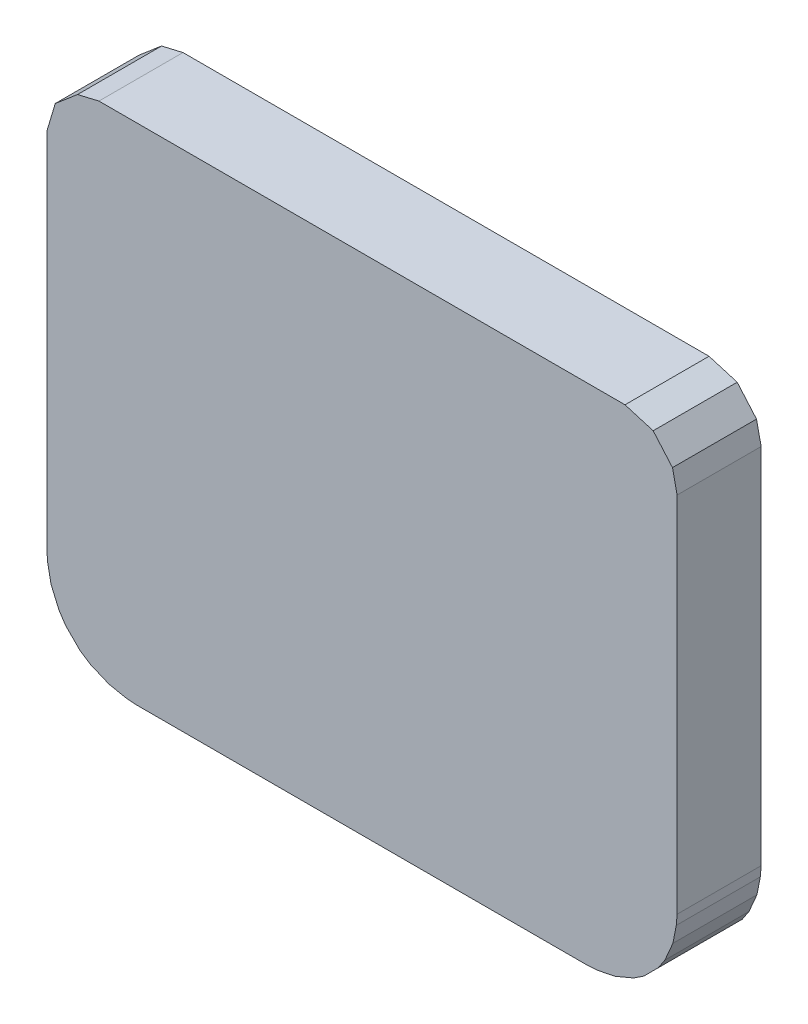
ISO-10303-21;
HEADER;
FILE_DESCRIPTION(('STEP AP214'),'2;1');
FILE_NAME('part.step','',(''),(''),'','','');
FILE_SCHEMA(('AUTOMOTIVE_DESIGN { 1 0 10303 214 1 1 1 1 }'));
ENDSEC;
DATA;
#1=APPLICATION_CONTEXT('core data for automotive mechanical design processes');
#2=APPLICATION_PROTOCOL_DEFINITION('international standard','automotive_design',2000,#1);
#3=PRODUCT_CONTEXT('',#1,'mechanical');
#4=PRODUCT('Part','Part','',(#3));
#5=PRODUCT_RELATED_PRODUCT_CATEGORY('part','',(#4));
#6=PRODUCT_DEFINITION_FORMATION('','',#4);
#7=PRODUCT_DEFINITION_CONTEXT('part definition',#1,'design');
#8=PRODUCT_DEFINITION('design','',#6,#7);
#9=PRODUCT_DEFINITION_SHAPE('','',#8);
#10=(LENGTH_UNIT() NAMED_UNIT(*) SI_UNIT(.MILLI.,.METRE.));
#11=(NAMED_UNIT(*) PLANE_ANGLE_UNIT() SI_UNIT($,.RADIAN.));
#12=(NAMED_UNIT(*) SI_UNIT($,.STERADIAN.) SOLID_ANGLE_UNIT());
#13=UNCERTAINTY_MEASURE_WITH_UNIT(LENGTH_MEASURE(1.E-05),#10,'distance_accuracy_value','');
#14=(GEOMETRIC_REPRESENTATION_CONTEXT(3) GLOBAL_UNCERTAINTY_ASSIGNED_CONTEXT((#13)) GLOBAL_UNIT_ASSIGNED_CONTEXT((#10,
#11,#12)) REPRESENTATION_CONTEXT('',''));
#15=CARTESIAN_POINT('',(0.,0.,0.));
#16=DIRECTION('',(0.,0.,1.));
#17=DIRECTION('',(1.,0.,0.));
#18=AXIS2_PLACEMENT_3D('',#15,#16,#17);
#19=CARTESIAN_POINT('',(6.85319712090404E-06,0.,0.2));
#20=DIRECTION('',(-0.28603552638829,-0.958219013401307,0.));
#21=DIRECTION('',(0.958219013401307,-0.28603552638829,0.));
#22=AXIS2_PLACEMENT_3D('',#19,#20,#21);
#23=PLANE('',#22);
#24=DIRECTION('',(-0.958219013401307,0.28603552638829,0.));
#25=VECTOR('',#24,1.);
#26=CARTESIAN_POINT('',(6.85319712090404E-06,0.,0.));
#27=LINE('',#26,#25);
#28=CARTESIAN_POINT('',(0.0670068531971324,-0.0199999999999922,0.));
#29=VERTEX_POINT('',#28);
#30=CARTESIAN_POINT('',(6.85319712090404E-06,0.,0.));
#31=VERTEX_POINT('',#30);
#32=EDGE_CURVE('E249',#29,#31,#27,.T.);
#33=ORIENTED_EDGE('',*,*,#32,.T.);
#34=DIRECTION('',(0.,0.,-1.));
#35=VECTOR('',#34,1.);
#36=CARTESIAN_POINT('',(6.85319712090404E-06,0.,0.2));
#37=LINE('',#36,#35);
#38=CARTESIAN_POINT('',(6.85319712090404E-06,0.,0.2));
#39=VERTEX_POINT('',#38);
#40=EDGE_CURVE('E11',#39,#31,#37,.T.);
#41=ORIENTED_EDGE('',*,*,#40,.F.);
#42=DIRECTION('',(-0.958219013401307,0.28603552638829,0.));
#43=VECTOR('',#42,1.);
#44=CARTESIAN_POINT('',(6.85319712090404E-06,0.,0.2));
#45=LINE('',#44,#43);
#46=CARTESIAN_POINT('',(0.0670068531971324,-0.0199999999999922,0.2));
#47=VERTEX_POINT('',#46);
#48=EDGE_CURVE('E303',#47,#39,#45,.T.);
#49=ORIENTED_EDGE('',*,*,#48,.F.);
#50=DIRECTION('',(0.,0.,-1.));
#51=VECTOR('',#50,1.);
#52=CARTESIAN_POINT('',(0.0670068531971324,-0.0199999999999922,0.2));
#53=LINE('',#52,#51);
#54=EDGE_CURVE('E245',#47,#29,#53,.T.);
#55=ORIENTED_EDGE('',*,*,#54,.T.);
#56=EDGE_LOOP('',(#33,#41,#49,#55));
#57=FACE_BOUND('',#56,.T.);
#58=ADVANCED_FACE('F33',(#57),#23,.F.);
#59=CARTESIAN_POINT('',(-1.25199314680288,0.,0.2));
#60=DIRECTION('',(0.,-1.,0.));
#61=DIRECTION('',(0.,0.,-1.));
#62=AXIS2_PLACEMENT_3D('',#59,#60,#61);
#63=PLANE('',#62);
#64=DIRECTION('',(-1.,0.,0.));
#65=VECTOR('',#64,1.);
#66=CARTESIAN_POINT('',(-1.25199314680288,0.,0.));
#67=LINE('',#66,#65);
#68=CARTESIAN_POINT('',(-1.25199314680288,0.,0.));
#69=VERTEX_POINT('',#68);
#70=EDGE_CURVE('E252',#31,#69,#67,.T.);
#71=ORIENTED_EDGE('',*,*,#70,.T.);
#72=DIRECTION('',(0.,0.,-1.));
#73=VECTOR('',#72,1.);
#74=CARTESIAN_POINT('',(-1.25199314680288,0.,0.2));
#75=LINE('',#74,#73);
#76=CARTESIAN_POINT('',(-1.25199314680288,0.,0.2));
#77=VERTEX_POINT('',#76);
#78=EDGE_CURVE('E41',#77,#69,#75,.T.);
#79=ORIENTED_EDGE('',*,*,#78,.F.);
#80=DIRECTION('',(-1.,0.,0.));
#81=VECTOR('',#80,1.);
#82=CARTESIAN_POINT('',(-1.25199314680288,0.,0.2));
#83=LINE('',#82,#81);
#84=EDGE_CURVE('E152',#39,#77,#83,.T.);
#85=ORIENTED_EDGE('',*,*,#84,.F.);
#86=ORIENTED_EDGE('',*,*,#40,.T.);
#87=EDGE_LOOP('',(#71,#79,#85,#86));
#88=FACE_BOUND('',#87,.T.);
#89=ADVANCED_FACE('F461',(#88),#63,.F.);
#90=CARTESIAN_POINT('',(-1.30299314680288,-0.012000000000012,0.2));
#91=DIRECTION('',(0.229039333725784,-0.97341716833352,0.));
#92=DIRECTION('',(0.973417168333521,0.229039333725784,0.));
#93=AXIS2_PLACEMENT_3D('',#90,#91,#92);
#94=PLANE('',#93);
#95=DIRECTION('',(-0.97341716833352,-0.229039333725784,0.));
#96=VECTOR('',#95,1.);
#97=CARTESIAN_POINT('',(-1.30299314680288,-0.012000000000012,0.));
#98=LINE('',#97,#96);
#99=CARTESIAN_POINT('',(-1.30299314680288,-0.012000000000012,0.));
#100=VERTEX_POINT('',#99);
#101=EDGE_CURVE('E254',#69,#100,#98,.T.);
#102=ORIENTED_EDGE('',*,*,#101,.T.);
#103=DIRECTION('',(0.,0.,-1.));
#104=VECTOR('',#103,1.);
#105=CARTESIAN_POINT('',(-1.30299314680288,-0.012000000000012,0.2));
#106=LINE('',#105,#104);
#107=CARTESIAN_POINT('',(-1.30299314680288,-0.012000000000012,0.2));
#108=VERTEX_POINT('',#107);
#109=EDGE_CURVE('E370',#108,#100,#106,.T.);
#110=ORIENTED_EDGE('',*,*,#109,.F.);
#111=DIRECTION('',(-0.97341716833352,-0.229039333725784,0.));
#112=VECTOR('',#111,1.);
#113=CARTESIAN_POINT('',(-1.30299314680288,-0.012000000000012,0.2));
#114=LINE('',#113,#112);
#115=EDGE_CURVE('E378',#77,#108,#114,.T.);
#116=ORIENTED_EDGE('',*,*,#115,.F.);
#117=ORIENTED_EDGE('',*,*,#78,.T.);
#118=EDGE_LOOP('',(#102,#110,#116,#117));
#119=FACE_BOUND('',#118,.T.);
#120=ADVANCED_FACE('F376',(#119),#94,.F.);
#121=CARTESIAN_POINT('',(-1.35599314680288,-0.0570000000000015,0.2));
#122=DIRECTION('',(0.647230821935877,-0.762294079169063,0.));
#123=DIRECTION('',(0.762294079169063,0.647230821935877,0.));
#124=AXIS2_PLACEMENT_3D('',#121,#122,#123);
#125=PLANE('',#124);
#126=DIRECTION('',(-0.762294079169063,-0.647230821935876,0.));
#127=VECTOR('',#126,1.);
#128=CARTESIAN_POINT('',(-1.35599314680288,-0.0570000000000015,0.));
#129=LINE('',#128,#127);
#130=CARTESIAN_POINT('',(-1.35599314680288,-0.0570000000000015,0.));
#131=VERTEX_POINT('',#130);
#132=EDGE_CURVE('E256',#100,#131,#129,.T.);
#133=ORIENTED_EDGE('',*,*,#132,.T.);
#134=DIRECTION('',(0.,0.,-1.));
#135=VECTOR('',#134,1.);
#136=CARTESIAN_POINT('',(-1.35599314680288,-0.0570000000000015,0.2));
#137=LINE('',#136,#135);
#138=CARTESIAN_POINT('',(-1.35599314680288,-0.0570000000000015,0.2));
#139=VERTEX_POINT('',#138);
#140=EDGE_CURVE('E367',#139,#131,#137,.T.);
#141=ORIENTED_EDGE('',*,*,#140,.F.);
#142=DIRECTION('',(-0.762294079169063,-0.647230821935876,0.));
#143=VECTOR('',#142,1.);
#144=CARTESIAN_POINT('',(-1.35599314680288,-0.0570000000000015,0.2));
#145=LINE('',#144,#143);
#146=EDGE_CURVE('E396',#108,#139,#145,.T.);
#147=ORIENTED_EDGE('',*,*,#146,.F.);
#148=ORIENTED_EDGE('',*,*,#109,.T.);
#149=EDGE_LOOP('',(#133,#141,#147,#148));
#150=FACE_BOUND('',#149,.T.);
#151=ADVANCED_FACE('F387',(#150),#125,.F.);
#152=CARTESIAN_POINT('',(-1.37599314680287,-0.123999999999985,0.2));
#153=DIRECTION('',(0.958219013401274,-0.286035526388399,0.));
#154=DIRECTION('',(0.286035526388399,0.958219013401275,0.));
#155=AXIS2_PLACEMENT_3D('',#152,#153,#154);
#156=PLANE('',#155);
#157=DIRECTION('',(-0.286035526388399,-0.958219013401274,0.));
#158=VECTOR('',#157,1.);
#159=CARTESIAN_POINT('',(-1.37599314680287,-0.123999999999985,0.));
#160=LINE('',#159,#158);
#161=CARTESIAN_POINT('',(-1.37599314680287,-0.123999999999985,0.));
#162=VERTEX_POINT('',#161);
#163=EDGE_CURVE('E258',#131,#162,#160,.T.);
#164=ORIENTED_EDGE('',*,*,#163,.T.);
#165=DIRECTION('',(0.,0.,-1.));
#166=VECTOR('',#165,1.);
#167=CARTESIAN_POINT('',(-1.37599314680287,-0.123999999999985,0.2));
#168=LINE('',#167,#166);
#169=CARTESIAN_POINT('',(-1.37599314680287,-0.123999999999985,0.2));
#170=VERTEX_POINT('',#169);
#171=EDGE_CURVE('E364',#170,#162,#168,.T.);
#172=ORIENTED_EDGE('',*,*,#171,.F.);
#173=DIRECTION('',(-0.286035526388399,-0.958219013401274,0.));
#174=VECTOR('',#173,1.);
#175=CARTESIAN_POINT('',(-1.37599314680287,-0.123999999999985,0.2));
#176=LINE('',#175,#174);
#177=EDGE_CURVE('E393',#139,#170,#176,.T.);
#178=ORIENTED_EDGE('',*,*,#177,.F.);
#179=ORIENTED_EDGE('',*,*,#140,.T.);
#180=EDGE_LOOP('',(#164,#172,#178,#179));
#181=FACE_BOUND('',#180,.T.);
#182=ADVANCED_FACE('F391',(#181),#156,.F.);
#183=CARTESIAN_POINT('',(-1.37599314680287,-0.987999999999989,0.2));
#184=DIRECTION('',(1.,0.,0.));
#185=DIRECTION('',(0.,0.,-1.));
#186=AXIS2_PLACEMENT_3D('',#183,#184,#185);
#187=PLANE('',#186);
#188=DIRECTION('',(0.,-1.,0.));
#189=VECTOR('',#188,1.);
#190=CARTESIAN_POINT('',(-1.37599314680287,-0.987999999999989,0.));
#191=LINE('',#190,#189);
#192=CARTESIAN_POINT('',(-1.37599314680287,-0.987999999999989,0.));
#193=VERTEX_POINT('',#192);
#194=EDGE_CURVE('E260',#162,#193,#191,.T.);
#195=ORIENTED_EDGE('',*,*,#194,.T.);
#196=DIRECTION('',(0.,0.,-1.));
#197=VECTOR('',#196,1.);
#198=CARTESIAN_POINT('',(-1.37599314680287,-0.987999999999989,0.2));
#199=LINE('',#198,#197);
#200=CARTESIAN_POINT('',(-1.37599314680287,-0.987999999999989,0.2));
#201=VERTEX_POINT('',#200);
#202=EDGE_CURVE('E361',#201,#193,#199,.T.);
#203=ORIENTED_EDGE('',*,*,#202,.F.);
#204=DIRECTION('',(0.,-1.,0.));
#205=VECTOR('',#204,1.);
#206=CARTESIAN_POINT('',(-1.37599314680287,-0.987999999999989,0.2));
#207=LINE('',#206,#205);
#208=EDGE_CURVE('E395',#170,#201,#207,.T.);
#209=ORIENTED_EDGE('',*,*,#208,.F.);
#210=ORIENTED_EDGE('',*,*,#171,.T.);
#211=EDGE_LOOP('',(#195,#203,#209,#210));
#212=FACE_BOUND('',#211,.T.);
#213=ADVANCED_FACE('F474',(#212),#187,.F.);
#214=CARTESIAN_POINT('',(-1.37399314680287,-1.01200000000001,0.2));
#215=DIRECTION('',(0.99654575824488,0.08304547985374,0.));
#216=DIRECTION('',(-0.08304547985374,0.99654575824488,0.));
#217=AXIS2_PLACEMENT_3D('',#214,#215,#216);
#218=PLANE('',#217);
#219=DIRECTION('',(0.08304547985374,-0.99654575824488,0.));
#220=VECTOR('',#219,1.);
#221=CARTESIAN_POINT('',(-1.37399314680287,-1.01200000000001,0.));
#222=LINE('',#221,#220);
#223=CARTESIAN_POINT('',(-1.37399314680287,-1.01200000000001,0.));
#224=VERTEX_POINT('',#223);
#225=EDGE_CURVE('E262',#193,#224,#222,.T.);
#226=ORIENTED_EDGE('',*,*,#225,.T.);
#227=DIRECTION('',(0.,0.,-1.));
#228=VECTOR('',#227,1.);
#229=CARTESIAN_POINT('',(-1.37399314680287,-1.01200000000001,0.2));
#230=LINE('',#229,#228);
#231=CARTESIAN_POINT('',(-1.37399314680287,-1.01200000000001,0.2));
#232=VERTEX_POINT('',#231);
#233=EDGE_CURVE('E358',#232,#224,#230,.T.);
#234=ORIENTED_EDGE('',*,*,#233,.F.);
#235=DIRECTION('',(0.08304547985374,-0.99654575824488,0.));
#236=VECTOR('',#235,1.);
#237=CARTESIAN_POINT('',(-1.37399314680287,-1.01200000000001,0.2));
#238=LINE('',#237,#236);
#239=EDGE_CURVE('E398',#201,#232,#238,.T.);
#240=ORIENTED_EDGE('',*,*,#239,.F.);
#241=ORIENTED_EDGE('',*,*,#202,.T.);
#242=EDGE_LOOP('',(#226,#234,#240,#241));
#243=FACE_BOUND('',#242,.T.);
#244=ADVANCED_FACE('F477',(#243),#218,.F.);
#245=CARTESIAN_POINT('',(-1.36599314680289,-1.053,0.2));
#246=DIRECTION('',(0.981490592025775,0.191510359419258,0.));
#247=DIRECTION('',(-0.191510359419258,0.981490592025775,0.));
#248=AXIS2_PLACEMENT_3D('',#245,#246,#247);
#249=PLANE('',#248);
#250=DIRECTION('',(0.191510359419258,-0.981490592025775,0.));
#251=VECTOR('',#250,1.);
#252=CARTESIAN_POINT('',(-1.36599314680289,-1.053,0.));
#253=LINE('',#252,#251);
#254=CARTESIAN_POINT('',(-1.36599314680289,-1.053,0.));
#255=VERTEX_POINT('',#254);
#256=EDGE_CURVE('E264',#224,#255,#253,.T.);
#257=ORIENTED_EDGE('',*,*,#256,.T.);
#258=DIRECTION('',(0.,0.,-1.));
#259=VECTOR('',#258,1.);
#260=CARTESIAN_POINT('',(-1.36599314680289,-1.053,0.2));
#261=LINE('',#260,#259);
#262=CARTESIAN_POINT('',(-1.36599314680289,-1.053,0.2));
#263=VERTEX_POINT('',#262);
#264=EDGE_CURVE('E355',#263,#255,#261,.T.);
#265=ORIENTED_EDGE('',*,*,#264,.F.);
#266=DIRECTION('',(0.191510359419258,-0.981490592025775,0.));
#267=VECTOR('',#266,1.);
#268=CARTESIAN_POINT('',(-1.36599314680289,-1.053,0.2));
#269=LINE('',#268,#267);
#270=EDGE_CURVE('E404',#232,#263,#269,.T.);
#271=ORIENTED_EDGE('',*,*,#270,.F.);
#272=ORIENTED_EDGE('',*,*,#233,.T.);
#273=EDGE_LOOP('',(#257,#265,#271,#272));
#274=FACE_BOUND('',#273,.T.);
#275=ADVANCED_FACE('F481',(#274),#249,.F.);
#276=CARTESIAN_POINT('',(-1.34699314680287,-1.09699999999999,0.2));
#277=DIRECTION('',(0.918062353536008,0.39643601630014,0.));
#278=DIRECTION('',(-0.39643601630014,0.918062353536009,0.));
#279=AXIS2_PLACEMENT_3D('',#276,#277,#278);
#280=PLANE('',#279);
#281=DIRECTION('',(0.39643601630014,-0.918062353536009,0.));
#282=VECTOR('',#281,1.);
#283=CARTESIAN_POINT('',(-1.34699314680287,-1.09699999999999,0.));
#284=LINE('',#283,#282);
#285=CARTESIAN_POINT('',(-1.34699314680287,-1.09699999999999,0.));
#286=VERTEX_POINT('',#285);
#287=EDGE_CURVE('E266',#255,#286,#284,.T.);
#288=ORIENTED_EDGE('',*,*,#287,.T.);
#289=DIRECTION('',(0.,0.,-1.));
#290=VECTOR('',#289,1.);
#291=CARTESIAN_POINT('',(-1.34699314680287,-1.09699999999999,0.2));
#292=LINE('',#291,#290);
#293=CARTESIAN_POINT('',(-1.34699314680287,-1.09699999999999,0.2));
#294=VERTEX_POINT('',#293);
#295=EDGE_CURVE('E352',#294,#286,#292,.T.);
#296=ORIENTED_EDGE('',*,*,#295,.F.);
#297=DIRECTION('',(0.39643601630014,-0.918062353536009,0.));
#298=VECTOR('',#297,1.);
#299=CARTESIAN_POINT('',(-1.34699314680287,-1.09699999999999,0.2));
#300=LINE('',#299,#298);
#301=EDGE_CURVE('E406',#263,#294,#300,.T.);
#302=ORIENTED_EDGE('',*,*,#301,.F.);
#303=ORIENTED_EDGE('',*,*,#264,.T.);
#304=EDGE_LOOP('',(#288,#296,#302,#303));
#305=FACE_BOUND('',#304,.T.);
#306=ADVANCED_FACE('F485',(#305),#280,.F.);
#307=CARTESIAN_POINT('',(-1.33099314680291,-1.12099999999998,0.2));
#308=DIRECTION('',(0.832050294338436,0.554700196224341,0.));
#309=DIRECTION('',(-0.554700196224341,0.832050294338436,0.));
#310=AXIS2_PLACEMENT_3D('',#307,#308,#309);
#311=PLANE('',#310);
#312=DIRECTION('',(0.554700196224341,-0.832050294338436,0.));
#313=VECTOR('',#312,1.);
#314=CARTESIAN_POINT('',(-1.33099314680291,-1.12099999999998,0.));
#315=LINE('',#314,#313);
#316=CARTESIAN_POINT('',(-1.33099314680291,-1.12099999999998,0.));
#317=VERTEX_POINT('',#316);
#318=EDGE_CURVE('E268',#286,#317,#315,.T.);
#319=ORIENTED_EDGE('',*,*,#318,.T.);
#320=DIRECTION('',(0.,0.,-1.));
#321=VECTOR('',#320,1.);
#322=CARTESIAN_POINT('',(-1.33099314680291,-1.12099999999998,0.2));
#323=LINE('',#322,#321);
#324=CARTESIAN_POINT('',(-1.33099314680291,-1.12099999999998,0.2));
#325=VERTEX_POINT('',#324);
#326=EDGE_CURVE('E349',#325,#317,#323,.T.);
#327=ORIENTED_EDGE('',*,*,#326,.F.);
#328=DIRECTION('',(0.554700196224341,-0.832050294338436,0.));
#329=VECTOR('',#328,1.);
#330=CARTESIAN_POINT('',(-1.33099314680291,-1.12099999999998,0.2));
#331=LINE('',#330,#329);
#332=EDGE_CURVE('E408',#294,#325,#331,.T.);
#333=ORIENTED_EDGE('',*,*,#332,.F.);
#334=ORIENTED_EDGE('',*,*,#295,.T.);
#335=EDGE_LOOP('',(#319,#327,#333,#334));
#336=FACE_BOUND('',#335,.T.);
#337=ADVANCED_FACE('F489',(#336),#311,.F.);
#338=CARTESIAN_POINT('',(-1.29699314680289,-1.155,0.2));
#339=DIRECTION('',(0.707106781186548,0.707106781186548,0.));
#340=DIRECTION('',(-0.707106781186548,0.707106781186548,0.));
#341=AXIS2_PLACEMENT_3D('',#338,#339,#340);
#342=PLANE('',#341);
#343=DIRECTION('',(0.707106781186548,-0.707106781186548,0.));
#344=VECTOR('',#343,1.);
#345=CARTESIAN_POINT('',(-1.29699314680289,-1.155,0.));
#346=LINE('',#345,#344);
#347=CARTESIAN_POINT('',(-1.29699314680289,-1.155,0.));
#348=VERTEX_POINT('',#347);
#349=EDGE_CURVE('E270',#317,#348,#346,.T.);
#350=ORIENTED_EDGE('',*,*,#349,.T.);
#351=DIRECTION('',(0.,0.,-1.));
#352=VECTOR('',#351,1.);
#353=CARTESIAN_POINT('',(-1.29699314680289,-1.155,0.2));
#354=LINE('',#353,#352);
#355=CARTESIAN_POINT('',(-1.29699314680289,-1.155,0.2));
#356=VERTEX_POINT('',#355);
#357=EDGE_CURVE('E346',#356,#348,#354,.T.);
#358=ORIENTED_EDGE('',*,*,#357,.F.);
#359=DIRECTION('',(0.707106781186548,-0.707106781186548,0.));
#360=VECTOR('',#359,1.);
#361=CARTESIAN_POINT('',(-1.29699314680289,-1.155,0.2));
#362=LINE('',#361,#360);
#363=EDGE_CURVE('E410',#325,#356,#362,.T.);
#364=ORIENTED_EDGE('',*,*,#363,.F.);
#365=ORIENTED_EDGE('',*,*,#326,.T.);
#366=EDGE_LOOP('',(#350,#358,#364,#365));
#367=FACE_BOUND('',#366,.T.);
#368=ADVANCED_FACE('F493',(#367),#342,.F.);
#369=CARTESIAN_POINT('',(-1.27299314680289,-1.17099999999999,0.2));
#370=DIRECTION('',(0.554700196225007,0.832050294337992,0.));
#371=DIRECTION('',(-0.832050294337992,0.554700196225007,0.));
#372=AXIS2_PLACEMENT_3D('',#369,#370,#371);
#373=PLANE('',#372);
#374=DIRECTION('',(0.832050294337992,-0.554700196225007,0.));
#375=VECTOR('',#374,1.);
#376=CARTESIAN_POINT('',(-1.27299314680289,-1.17099999999999,0.));
#377=LINE('',#376,#375);
#378=CARTESIAN_POINT('',(-1.27299314680289,-1.17099999999999,0.));
#379=VERTEX_POINT('',#378);
#380=EDGE_CURVE('E272',#348,#379,#377,.T.);
#381=ORIENTED_EDGE('',*,*,#380,.T.);
#382=DIRECTION('',(0.,0.,-1.));
#383=VECTOR('',#382,1.);
#384=CARTESIAN_POINT('',(-1.27299314680289,-1.17099999999999,0.2));
#385=LINE('',#384,#383);
#386=CARTESIAN_POINT('',(-1.27299314680289,-1.17099999999999,0.2));
#387=VERTEX_POINT('',#386);
#388=EDGE_CURVE('E343',#387,#379,#385,.T.);
#389=ORIENTED_EDGE('',*,*,#388,.F.);
#390=DIRECTION('',(0.832050294337992,-0.554700196225007,0.));
#391=VECTOR('',#390,1.);
#392=CARTESIAN_POINT('',(-1.27299314680289,-1.17099999999999,0.2));
#393=LINE('',#392,#391);
#394=EDGE_CURVE('E412',#356,#387,#393,.T.);
#395=ORIENTED_EDGE('',*,*,#394,.F.);
#396=ORIENTED_EDGE('',*,*,#357,.T.);
#397=EDGE_LOOP('',(#381,#389,#395,#396));
#398=FACE_BOUND('',#397,.T.);
#399=ADVANCED_FACE('F497',(#398),#373,.F.);
#400=CARTESIAN_POINT('',(-1.2279931468029,-1.19000000000001,0.2));
#401=DIRECTION('',(0.38897203704077,0.921249561411214,0.));
#402=DIRECTION('',(-0.921249561411214,0.38897203704077,0.));
#403=AXIS2_PLACEMENT_3D('',#400,#401,#402);
#404=PLANE('',#403);
#405=DIRECTION('',(0.921249561411214,-0.38897203704077,0.));
#406=VECTOR('',#405,1.);
#407=CARTESIAN_POINT('',(-1.2279931468029,-1.19000000000001,0.));
#408=LINE('',#407,#406);
#409=CARTESIAN_POINT('',(-1.2279931468029,-1.19000000000001,0.));
#410=VERTEX_POINT('',#409);
#411=EDGE_CURVE('E274',#379,#410,#408,.T.);
#412=ORIENTED_EDGE('',*,*,#411,.T.);
#413=DIRECTION('',(0.,0.,-1.));
#414=VECTOR('',#413,1.);
#415=CARTESIAN_POINT('',(-1.2279931468029,-1.19000000000001,0.2));
#416=LINE('',#415,#414);
#417=CARTESIAN_POINT('',(-1.2279931468029,-1.19000000000001,0.2));
#418=VERTEX_POINT('',#417);
#419=EDGE_CURVE('E340',#418,#410,#416,.T.);
#420=ORIENTED_EDGE('',*,*,#419,.F.);
#421=DIRECTION('',(0.921249561411214,-0.38897203704077,0.));
#422=VECTOR('',#421,1.);
#423=CARTESIAN_POINT('',(-1.2279931468029,-1.19000000000001,0.2));
#424=LINE('',#423,#422);
#425=EDGE_CURVE('E414',#387,#418,#424,.T.);
#426=ORIENTED_EDGE('',*,*,#425,.F.);
#427=ORIENTED_EDGE('',*,*,#388,.T.);
#428=EDGE_LOOP('',(#412,#420,#426,#427));
#429=FACE_BOUND('',#428,.T.);
#430=ADVANCED_FACE('F501',(#429),#404,.F.);
#431=CARTESIAN_POINT('',(-1.18799314680292,-1.19799999999999,0.2));
#432=DIRECTION('',(0.196116135137791,0.980580675690999,0.));
#433=DIRECTION('',(-0.980580675690999,0.196116135137791,0.));
#434=AXIS2_PLACEMENT_3D('',#431,#432,#433);
#435=PLANE('',#434);
#436=DIRECTION('',(0.980580675690999,-0.196116135137791,0.));
#437=VECTOR('',#436,1.);
#438=CARTESIAN_POINT('',(-1.18799314680292,-1.19799999999999,0.));
#439=LINE('',#438,#437);
#440=CARTESIAN_POINT('',(-1.18799314680292,-1.19799999999999,0.));
#441=VERTEX_POINT('',#440);
#442=EDGE_CURVE('E276',#410,#441,#439,.T.);
#443=ORIENTED_EDGE('',*,*,#442,.T.);
#444=DIRECTION('',(0.,0.,-1.));
#445=VECTOR('',#444,1.);
#446=CARTESIAN_POINT('',(-1.18799314680292,-1.19799999999999,0.2));
#447=LINE('',#446,#445);
#448=CARTESIAN_POINT('',(-1.18799314680292,-1.19799999999999,0.2));
#449=VERTEX_POINT('',#448);
#450=EDGE_CURVE('E337',#449,#441,#447,.T.);
#451=ORIENTED_EDGE('',*,*,#450,.F.);
#452=DIRECTION('',(0.980580675690999,-0.196116135137791,0.));
#453=VECTOR('',#452,1.);
#454=CARTESIAN_POINT('',(-1.18799314680292,-1.19799999999999,0.2));
#455=LINE('',#454,#453);
#456=EDGE_CURVE('E416',#418,#449,#455,.T.);
#457=ORIENTED_EDGE('',*,*,#456,.F.);
#458=ORIENTED_EDGE('',*,*,#419,.T.);
#459=EDGE_LOOP('',(#443,#451,#457,#458));
#460=FACE_BOUND('',#459,.T.);
#461=ADVANCED_FACE('F505',(#460),#435,.F.);
#462=CARTESIAN_POINT('',(-1.16399314680289,-1.19999999999999,0.2));
#463=DIRECTION('',(0.08304547985374,0.99654575824488,0.));
#464=DIRECTION('',(-0.99654575824488,0.08304547985374,0.));
#465=AXIS2_PLACEMENT_3D('',#462,#463,#464);
#466=PLANE('',#465);
#467=DIRECTION('',(0.99654575824488,-0.08304547985374,0.));
#468=VECTOR('',#467,1.);
#469=CARTESIAN_POINT('',(-1.16399314680289,-1.19999999999999,0.));
#470=LINE('',#469,#468);
#471=CARTESIAN_POINT('',(-1.16399314680289,-1.19999999999999,0.));
#472=VERTEX_POINT('',#471);
#473=EDGE_CURVE('E278',#441,#472,#470,.T.);
#474=ORIENTED_EDGE('',*,*,#473,.T.);
#475=DIRECTION('',(0.,0.,-1.));
#476=VECTOR('',#475,1.);
#477=CARTESIAN_POINT('',(-1.16399314680289,-1.19999999999999,0.2));
#478=LINE('',#477,#476);
#479=CARTESIAN_POINT('',(-1.16399314680289,-1.19999999999999,0.2));
#480=VERTEX_POINT('',#479);
#481=EDGE_CURVE('E334',#480,#472,#478,.T.);
#482=ORIENTED_EDGE('',*,*,#481,.F.);
#483=DIRECTION('',(0.99654575824488,-0.08304547985374,0.));
#484=VECTOR('',#483,1.);
#485=CARTESIAN_POINT('',(-1.16399314680289,-1.19999999999999,0.2));
#486=LINE('',#485,#484);
#487=EDGE_CURVE('E418',#449,#480,#486,.T.);
#488=ORIENTED_EDGE('',*,*,#487,.F.);
#489=ORIENTED_EDGE('',*,*,#450,.T.);
#490=EDGE_LOOP('',(#474,#482,#488,#489));
#491=FACE_BOUND('',#490,.T.);
#492=ADVANCED_FACE('F509',(#491),#466,.F.);
#493=CARTESIAN_POINT('',(-0.0879931468028977,-1.19999999999999,0.2));
#494=DIRECTION('',(0.,1.,0.));
#495=DIRECTION('',(0.,0.,1.));
#496=AXIS2_PLACEMENT_3D('',#493,#494,#495);
#497=PLANE('',#496);
#498=DIRECTION('',(1.,0.,0.));
#499=VECTOR('',#498,1.);
#500=CARTESIAN_POINT('',(-0.0879931468028977,-1.19999999999999,0.));
#501=LINE('',#500,#499);
#502=CARTESIAN_POINT('',(-0.0879931468028977,-1.19999999999999,0.));
#503=VERTEX_POINT('',#502);
#504=EDGE_CURVE('E280',#472,#503,#501,.T.);
#505=ORIENTED_EDGE('',*,*,#504,.T.);
#506=DIRECTION('',(0.,0.,-1.));
#507=VECTOR('',#506,1.);
#508=CARTESIAN_POINT('',(-0.0879931468028977,-1.19999999999999,0.2));
#509=LINE('',#508,#507);
#510=CARTESIAN_POINT('',(-0.0879931468028977,-1.19999999999999,0.2));
#511=VERTEX_POINT('',#510);
#512=EDGE_CURVE('E331',#511,#503,#509,.T.);
#513=ORIENTED_EDGE('',*,*,#512,.F.);
#514=DIRECTION('',(1.,0.,0.));
#515=VECTOR('',#514,1.);
#516=CARTESIAN_POINT('',(-0.0879931468028977,-1.19999999999999,0.2));
#517=LINE('',#516,#515);
#518=EDGE_CURVE('E420',#480,#511,#517,.T.);
#519=ORIENTED_EDGE('',*,*,#518,.F.);
#520=ORIENTED_EDGE('',*,*,#481,.T.);
#521=EDGE_LOOP('',(#505,#513,#519,#520));
#522=FACE_BOUND('',#521,.T.);
#523=ADVANCED_FACE('F513',(#522),#497,.F.);
#524=CARTESIAN_POINT('',(-0.0639931468029015,-1.19799999999999,0.2));
#525=DIRECTION('',(-0.0830454798538353,0.996545758244872,0.));
#526=DIRECTION('',(-0.996545758244872,-0.0830454798538353,0.));
#527=AXIS2_PLACEMENT_3D('',#524,#525,#526);
#528=PLANE('',#527);
#529=DIRECTION('',(0.996545758244872,0.0830454798538353,0.));
#530=VECTOR('',#529,1.);
#531=CARTESIAN_POINT('',(-0.0639931468029015,-1.19799999999999,0.));
#532=LINE('',#531,#530);
#533=CARTESIAN_POINT('',(-0.0639931468029015,-1.19799999999999,0.));
#534=VERTEX_POINT('',#533);
#535=EDGE_CURVE('E282',#503,#534,#532,.T.);
#536=ORIENTED_EDGE('',*,*,#535,.T.);
#537=DIRECTION('',(0.,0.,-1.));
#538=VECTOR('',#537,1.);
#539=CARTESIAN_POINT('',(-0.0639931468029015,-1.19799999999999,0.2));
#540=LINE('',#539,#538);
#541=CARTESIAN_POINT('',(-0.0639931468029015,-1.19799999999999,0.2));
#542=VERTEX_POINT('',#541);
#543=EDGE_CURVE('E328',#542,#534,#540,.T.);
#544=ORIENTED_EDGE('',*,*,#543,.F.);
#545=DIRECTION('',(0.996545758244872,0.0830454798538353,0.));
#546=VECTOR('',#545,1.);
#547=CARTESIAN_POINT('',(-0.0639931468029015,-1.19799999999999,0.2));
#548=LINE('',#547,#546);
#549=EDGE_CURVE('E422',#511,#542,#548,.T.);
#550=ORIENTED_EDGE('',*,*,#549,.F.);
#551=ORIENTED_EDGE('',*,*,#512,.T.);
#552=EDGE_LOOP('',(#536,#544,#550,#551));
#553=FACE_BOUND('',#552,.T.);
#554=ADVANCED_FACE('F517',(#553),#528,.F.);
#555=CARTESIAN_POINT('',(-0.0239931468028892,-1.19000000000001,0.2));
#556=DIRECTION('',(-0.196116135137661,0.980580675691025,0.));
#557=DIRECTION('',(-0.980580675691025,-0.196116135137661,0.));
#558=AXIS2_PLACEMENT_3D('',#555,#556,#557);
#559=PLANE('',#558);
#560=DIRECTION('',(0.980580675691025,0.196116135137661,0.));
#561=VECTOR('',#560,1.);
#562=CARTESIAN_POINT('',(-0.0239931468028892,-1.19000000000001,0.));
#563=LINE('',#562,#561);
#564=CARTESIAN_POINT('',(-0.0239931468028892,-1.19000000000001,0.));
#565=VERTEX_POINT('',#564);
#566=EDGE_CURVE('E284',#534,#565,#563,.T.);
#567=ORIENTED_EDGE('',*,*,#566,.T.);
#568=DIRECTION('',(0.,0.,-1.));
#569=VECTOR('',#568,1.);
#570=CARTESIAN_POINT('',(-0.0239931468028892,-1.19000000000001,0.2));
#571=LINE('',#570,#569);
#572=CARTESIAN_POINT('',(-0.0239931468028892,-1.19000000000001,0.2));
#573=VERTEX_POINT('',#572);
#574=EDGE_CURVE('E325',#573,#565,#571,.T.);
#575=ORIENTED_EDGE('',*,*,#574,.F.);
#576=DIRECTION('',(0.980580675691025,0.196116135137661,0.));
#577=VECTOR('',#576,1.);
#578=CARTESIAN_POINT('',(-0.0239931468028892,-1.19000000000001,0.2));
#579=LINE('',#578,#577);
#580=EDGE_CURVE('E424',#542,#573,#579,.T.);
#581=ORIENTED_EDGE('',*,*,#580,.F.);
#582=ORIENTED_EDGE('',*,*,#543,.T.);
#583=EDGE_LOOP('',(#567,#575,#581,#582));
#584=FACE_BOUND('',#583,.T.);
#585=ADVANCED_FACE('F521',(#584),#559,.F.);
#586=CARTESIAN_POINT('',(0.0210068531971003,-1.17099999999999,0.2));
#587=DIRECTION('',(-0.38897203704077,0.921249561411214,0.));
#588=DIRECTION('',(-0.921249561411214,-0.38897203704077,0.));
#589=AXIS2_PLACEMENT_3D('',#586,#587,#588);
#590=PLANE('',#589);
#591=DIRECTION('',(0.921249561411214,0.38897203704077,0.));
#592=VECTOR('',#591,1.);
#593=CARTESIAN_POINT('',(0.0210068531971003,-1.17099999999999,0.));
#594=LINE('',#593,#592);
#595=CARTESIAN_POINT('',(0.0210068531971003,-1.17099999999999,0.));
#596=VERTEX_POINT('',#595);
#597=EDGE_CURVE('E286',#565,#596,#594,.T.);
#598=ORIENTED_EDGE('',*,*,#597,.T.);
#599=DIRECTION('',(0.,0.,-1.));
#600=VECTOR('',#599,1.);
#601=CARTESIAN_POINT('',(0.0210068531971003,-1.17099999999999,0.2));
#602=LINE('',#601,#600);
#603=CARTESIAN_POINT('',(0.0210068531971003,-1.17099999999999,0.2));
#604=VERTEX_POINT('',#603);
#605=EDGE_CURVE('E322',#604,#596,#602,.T.);
#606=ORIENTED_EDGE('',*,*,#605,.F.);
#607=DIRECTION('',(0.921249561411214,0.38897203704077,0.));
#608=VECTOR('',#607,1.);
#609=CARTESIAN_POINT('',(0.0210068531971003,-1.17099999999999,0.2));
#610=LINE('',#609,#608);
#611=EDGE_CURVE('E426',#573,#604,#610,.T.);
#612=ORIENTED_EDGE('',*,*,#611,.F.);
#613=ORIENTED_EDGE('',*,*,#574,.T.);
#614=EDGE_LOOP('',(#598,#606,#612,#613));
#615=FACE_BOUND('',#614,.T.);
#616=ADVANCED_FACE('F525',(#615),#590,.F.);
#617=CARTESIAN_POINT('',(0.0450068531970965,-1.155,0.2));
#618=DIRECTION('',(-0.554700196225007,0.832050294337992,0.));
#619=DIRECTION('',(-0.832050294337992,-0.554700196225007,0.));
#620=AXIS2_PLACEMENT_3D('',#617,#618,#619);
#621=PLANE('',#620);
#622=DIRECTION('',(0.832050294337992,0.554700196225007,0.));
#623=VECTOR('',#622,1.);
#624=CARTESIAN_POINT('',(0.0450068531970965,-1.155,0.));
#625=LINE('',#624,#623);
#626=CARTESIAN_POINT('',(0.0450068531970965,-1.155,0.));
#627=VERTEX_POINT('',#626);
#628=EDGE_CURVE('E288',#596,#627,#625,.T.);
#629=ORIENTED_EDGE('',*,*,#628,.T.);
#630=DIRECTION('',(0.,0.,-1.));
#631=VECTOR('',#630,1.);
#632=CARTESIAN_POINT('',(0.0450068531970965,-1.155,0.2));
#633=LINE('',#632,#631);
#634=CARTESIAN_POINT('',(0.0450068531970965,-1.155,0.2));
#635=VERTEX_POINT('',#634);
#636=EDGE_CURVE('E319',#635,#627,#633,.T.);
#637=ORIENTED_EDGE('',*,*,#636,.F.);
#638=DIRECTION('',(0.832050294337992,0.554700196225007,0.));
#639=VECTOR('',#638,1.);
#640=CARTESIAN_POINT('',(0.0450068531970965,-1.155,0.2));
#641=LINE('',#640,#639);
#642=EDGE_CURVE('E428',#604,#635,#641,.T.);
#643=ORIENTED_EDGE('',*,*,#642,.F.);
#644=ORIENTED_EDGE('',*,*,#605,.T.);
#645=EDGE_LOOP('',(#629,#637,#643,#644));
#646=FACE_BOUND('',#645,.T.);
#647=ADVANCED_FACE('F529',(#646),#621,.F.);
#648=CARTESIAN_POINT('',(0.0790068531971028,-1.121,0.2));
#649=DIRECTION('',(-0.707106781186548,0.707106781186548,0.));
#650=DIRECTION('',(-0.707106781186548,-0.707106781186548,0.));
#651=AXIS2_PLACEMENT_3D('',#648,#649,#650);
#652=PLANE('',#651);
#653=DIRECTION('',(0.707106781186548,0.707106781186547,0.));
#654=VECTOR('',#653,1.);
#655=CARTESIAN_POINT('',(0.0790068531971028,-1.121,0.));
#656=LINE('',#655,#654);
#657=CARTESIAN_POINT('',(0.0790068531971028,-1.121,0.));
#658=VERTEX_POINT('',#657);
#659=EDGE_CURVE('E290',#627,#658,#656,.T.);
#660=ORIENTED_EDGE('',*,*,#659,.T.);
#661=DIRECTION('',(0.,0.,-1.));
#662=VECTOR('',#661,1.);
#663=CARTESIAN_POINT('',(0.0790068531971028,-1.121,0.2));
#664=LINE('',#663,#662);
#665=CARTESIAN_POINT('',(0.0790068531971028,-1.121,0.2));
#666=VERTEX_POINT('',#665);
#667=EDGE_CURVE('E316',#666,#658,#664,.T.);
#668=ORIENTED_EDGE('',*,*,#667,.F.);
#669=DIRECTION('',(0.707106781186548,0.707106781186547,0.));
#670=VECTOR('',#669,1.);
#671=CARTESIAN_POINT('',(0.0790068531971028,-1.121,0.2));
#672=LINE('',#671,#670);
#673=EDGE_CURVE('E430',#635,#666,#672,.T.);
#674=ORIENTED_EDGE('',*,*,#673,.F.);
#675=ORIENTED_EDGE('',*,*,#636,.T.);
#676=EDGE_LOOP('',(#660,#668,#674,#675));
#677=FACE_BOUND('',#676,.T.);
#678=ADVANCED_FACE('F533',(#677),#652,.F.);
#679=CARTESIAN_POINT('',(0.095006853197091,-1.097,0.2));
#680=DIRECTION('',(-0.832050294337992,0.554700196225007,0.));
#681=DIRECTION('',(-0.554700196225007,-0.832050294337992,0.));
#682=AXIS2_PLACEMENT_3D('',#679,#680,#681);
#683=PLANE('',#682);
#684=DIRECTION('',(0.554700196225007,0.832050294337992,0.));
#685=VECTOR('',#684,1.);
#686=CARTESIAN_POINT('',(0.095006853197091,-1.097,0.));
#687=LINE('',#686,#685);
#688=CARTESIAN_POINT('',(0.095006853197091,-1.097,0.));
#689=VERTEX_POINT('',#688);
#690=EDGE_CURVE('E292',#658,#689,#687,.T.);
#691=ORIENTED_EDGE('',*,*,#690,.T.);
#692=DIRECTION('',(0.,0.,-1.));
#693=VECTOR('',#692,1.);
#694=CARTESIAN_POINT('',(0.095006853197091,-1.097,0.2));
#695=LINE('',#694,#693);
#696=CARTESIAN_POINT('',(0.095006853197091,-1.097,0.2));
#697=VERTEX_POINT('',#696);
#698=EDGE_CURVE('E313',#697,#689,#695,.T.);
#699=ORIENTED_EDGE('',*,*,#698,.F.);
#700=DIRECTION('',(0.554700196225007,0.832050294337992,0.));
#701=VECTOR('',#700,1.);
#702=CARTESIAN_POINT('',(0.095006853197091,-1.097,0.2));
#703=LINE('',#702,#701);
#704=EDGE_CURVE('E432',#666,#697,#703,.T.);
#705=ORIENTED_EDGE('',*,*,#704,.F.);
#706=ORIENTED_EDGE('',*,*,#667,.T.);
#707=EDGE_LOOP('',(#691,#699,#705,#706));
#708=FACE_BOUND('',#707,.T.);
#709=ADVANCED_FACE('F537',(#708),#683,.F.);
#710=CARTESIAN_POINT('',(0.11400685319711,-1.05300000000001,0.2));
#711=DIRECTION('',(-0.918062353536008,0.39643601630014,0.));
#712=DIRECTION('',(-0.39643601630014,-0.918062353536009,0.));
#713=AXIS2_PLACEMENT_3D('',#710,#711,#712);
#714=PLANE('',#713);
#715=DIRECTION('',(0.39643601630014,0.918062353536009,0.));
#716=VECTOR('',#715,1.);
#717=CARTESIAN_POINT('',(0.11400685319711,-1.05300000000001,0.));
#718=LINE('',#717,#716);
#719=CARTESIAN_POINT('',(0.11400685319711,-1.05300000000001,0.));
#720=VERTEX_POINT('',#719);
#721=EDGE_CURVE('E294',#689,#720,#718,.T.);
#722=ORIENTED_EDGE('',*,*,#721,.T.);
#723=DIRECTION('',(0.,0.,-1.));
#724=VECTOR('',#723,1.);
#725=CARTESIAN_POINT('',(0.11400685319711,-1.05300000000001,0.2));
#726=LINE('',#725,#724);
#727=CARTESIAN_POINT('',(0.11400685319711,-1.05300000000001,0.2));
#728=VERTEX_POINT('',#727);
#729=EDGE_CURVE('E310',#728,#720,#726,.T.);
#730=ORIENTED_EDGE('',*,*,#729,.F.);
#731=DIRECTION('',(0.39643601630014,0.918062353536009,0.));
#732=VECTOR('',#731,1.);
#733=CARTESIAN_POINT('',(0.11400685319711,-1.05300000000001,0.2));
#734=LINE('',#733,#732);
#735=EDGE_CURVE('E434',#697,#728,#734,.T.);
#736=ORIENTED_EDGE('',*,*,#735,.F.);
#737=ORIENTED_EDGE('',*,*,#698,.T.);
#738=EDGE_LOOP('',(#722,#730,#736,#737));
#739=FACE_BOUND('',#738,.T.);
#740=ADVANCED_FACE('F541',(#739),#714,.F.);
#741=CARTESIAN_POINT('',(0.12200685319709,-1.01200000000003,0.2));
#742=DIRECTION('',(-0.981490592025775,0.191510359419258,0.));
#743=DIRECTION('',(-0.191510359419258,-0.981490592025775,0.));
#744=AXIS2_PLACEMENT_3D('',#741,#742,#743);
#745=PLANE('',#744);
#746=DIRECTION('',(0.191510359419258,0.981490592025775,0.));
#747=VECTOR('',#746,1.);
#748=CARTESIAN_POINT('',(0.12200685319709,-1.01200000000003,0.));
#749=LINE('',#748,#747);
#750=CARTESIAN_POINT('',(0.12200685319709,-1.01200000000003,0.));
#751=VERTEX_POINT('',#750);
#752=EDGE_CURVE('E296',#720,#751,#749,.T.);
#753=ORIENTED_EDGE('',*,*,#752,.T.);
#754=DIRECTION('',(0.,0.,-1.));
#755=VECTOR('',#754,1.);
#756=CARTESIAN_POINT('',(0.12200685319709,-1.01200000000003,0.2));
#757=LINE('',#756,#755);
#758=CARTESIAN_POINT('',(0.12200685319709,-1.01200000000003,0.2));
#759=VERTEX_POINT('',#758);
#760=EDGE_CURVE('E307',#759,#751,#757,.T.);
#761=ORIENTED_EDGE('',*,*,#760,.F.);
#762=DIRECTION('',(0.191510359419258,0.981490592025775,0.));
#763=VECTOR('',#762,1.);
#764=CARTESIAN_POINT('',(0.12200685319709,-1.01200000000003,0.2));
#765=LINE('',#764,#763);
#766=EDGE_CURVE('E436',#728,#759,#765,.T.);
#767=ORIENTED_EDGE('',*,*,#766,.F.);
#768=ORIENTED_EDGE('',*,*,#729,.T.);
#769=EDGE_LOOP('',(#753,#761,#767,#768));
#770=FACE_BOUND('',#769,.T.);
#771=ADVANCED_FACE('F442',(#770),#745,.F.);
#772=CARTESIAN_POINT('',(0.12400685319712,-0.988000000000003,0.2));
#773=DIRECTION('',(-0.996545758244784,0.0830454798548845,0.));
#774=DIRECTION('',(-0.0830454798548845,-0.996545758244784,0.));
#775=AXIS2_PLACEMENT_3D('',#772,#773,#774);
#776=PLANE('',#775);
#777=DIRECTION('',(0.0830454798548845,0.996545758244784,0.));
#778=VECTOR('',#777,1.);
#779=CARTESIAN_POINT('',(0.12400685319712,-0.988000000000003,0.));
#780=LINE('',#779,#778);
#781=CARTESIAN_POINT('',(0.12400685319712,-0.988000000000003,0.));
#782=VERTEX_POINT('',#781);
#783=EDGE_CURVE('E298',#751,#782,#780,.T.);
#784=ORIENTED_EDGE('',*,*,#783,.T.);
#785=DIRECTION('',(0.,0.,-1.));
#786=VECTOR('',#785,1.);
#787=CARTESIAN_POINT('',(0.12400685319712,-0.988000000000003,0.2));
#788=LINE('',#787,#786);
#789=CARTESIAN_POINT('',(0.12400685319712,-0.988000000000003,0.2));
#790=VERTEX_POINT('',#789);
#791=EDGE_CURVE('E240',#790,#782,#788,.T.);
#792=ORIENTED_EDGE('',*,*,#791,.F.);
#793=DIRECTION('',(0.0830454798548845,0.996545758244784,0.));
#794=VECTOR('',#793,1.);
#795=CARTESIAN_POINT('',(0.12400685319712,-0.988000000000003,0.2));
#796=LINE('',#795,#794);
#797=EDGE_CURVE('E231',#759,#790,#796,.T.);
#798=ORIENTED_EDGE('',*,*,#797,.F.);
#799=ORIENTED_EDGE('',*,*,#760,.T.);
#800=EDGE_LOOP('',(#784,#792,#798,#799));
#801=FACE_BOUND('',#800,.T.);
#802=ADVANCED_FACE('F446',(#801),#776,.F.);
#803=CARTESIAN_POINT('',(0.124006853197134,-0.123999999999985,0.2));
#804=DIRECTION('',(-1.,0.,0.));
#805=DIRECTION('',(0.,-1.,0.));
#806=AXIS2_PLACEMENT_3D('',#803,#804,#805);
#807=PLANE('',#806);
#808=DIRECTION('',(0.,1.,0.));
#809=VECTOR('',#808,1.);
#810=CARTESIAN_POINT('',(0.124006853197134,-0.123999999999985,0.));
#811=LINE('',#810,#809);
#812=CARTESIAN_POINT('',(0.124006853197134,-0.123999999999985,0.));
#813=VERTEX_POINT('',#812);
#814=EDGE_CURVE('E239',#782,#813,#811,.T.);
#815=ORIENTED_EDGE('',*,*,#814,.T.);
#816=DIRECTION('',(0.,0.,-1.));
#817=VECTOR('',#816,1.);
#818=CARTESIAN_POINT('',(0.124006853197134,-0.123999999999985,0.2));
#819=LINE('',#818,#817);
#820=CARTESIAN_POINT('',(0.124006853197134,-0.123999999999985,0.2));
#821=VERTEX_POINT('',#820);
#822=EDGE_CURVE('E236',#821,#813,#819,.T.);
#823=ORIENTED_EDGE('',*,*,#822,.F.);
#824=DIRECTION('',(0.,1.,0.));
#825=VECTOR('',#824,1.);
#826=CARTESIAN_POINT('',(0.124006853197134,-0.123999999999985,0.2));
#827=LINE('',#826,#825);
#828=EDGE_CURVE('E225',#790,#821,#827,.T.);
#829=ORIENTED_EDGE('',*,*,#828,.F.);
#830=ORIENTED_EDGE('',*,*,#791,.T.);
#831=EDGE_LOOP('',(#815,#823,#829,#830));
#832=FACE_BOUND('',#831,.T.);
#833=ADVANCED_FACE('F237',(#832),#807,.F.);
#834=CARTESIAN_POINT('',(0.113006853197123,-0.0729999999999897,0.2));
#835=DIRECTION('',(-0.977521044082281,-0.210837872253271,0.));
#836=DIRECTION('',(0.210837872253271,-0.977521044082281,0.));
#837=AXIS2_PLACEMENT_3D('',#834,#835,#836);
#838=PLANE('',#837);
#839=DIRECTION('',(-0.210837872253271,0.977521044082281,0.));
#840=VECTOR('',#839,1.);
#841=CARTESIAN_POINT('',(0.113006853197123,-0.0729999999999897,0.));
#842=LINE('',#841,#840);
#843=CARTESIAN_POINT('',(0.113006853197123,-0.0729999999999897,0.));
#844=VERTEX_POINT('',#843);
#845=EDGE_CURVE('E138',#813,#844,#842,.T.);
#846=ORIENTED_EDGE('',*,*,#845,.T.);
#847=DIRECTION('',(0.,0.,-1.));
#848=VECTOR('',#847,1.);
#849=CARTESIAN_POINT('',(0.113006853197123,-0.0729999999999897,0.2));
#850=LINE('',#849,#848);
#851=CARTESIAN_POINT('',(0.113006853197123,-0.0729999999999897,0.2));
#852=VERTEX_POINT('',#851);
#853=EDGE_CURVE('E241',#852,#844,#850,.T.);
#854=ORIENTED_EDGE('',*,*,#853,.F.);
#855=DIRECTION('',(-0.210837872253271,0.977521044082281,0.));
#856=VECTOR('',#855,1.);
#857=CARTESIAN_POINT('',(0.113006853197123,-0.0729999999999897,0.2));
#858=LINE('',#857,#856);
#859=EDGE_CURVE('E229',#821,#852,#858,.T.);
#860=ORIENTED_EDGE('',*,*,#859,.F.);
#861=ORIENTED_EDGE('',*,*,#822,.T.);
#862=EDGE_LOOP('',(#846,#854,#860,#861));
#863=FACE_BOUND('',#862,.T.);
#864=ADVANCED_FACE('F243',(#863),#838,.F.);
#865=CARTESIAN_POINT('',(0.0670068531971324,-0.0199999999999922,0.2));
#866=DIRECTION('',(-0.755218729871894,-0.655472859888709,0.));
#867=DIRECTION('',(0.655472859888709,-0.755218729871894,0.));
#868=AXIS2_PLACEMENT_3D('',#865,#866,#867);
#869=PLANE('',#868);
#870=DIRECTION('',(-0.655472859888709,0.755218729871894,0.));
#871=VECTOR('',#870,1.);
#872=CARTESIAN_POINT('',(0.0670068531971324,-0.0199999999999922,0.));
#873=LINE('',#872,#871);
#874=EDGE_CURVE('E144',#844,#29,#873,.T.);
#875=ORIENTED_EDGE('',*,*,#874,.T.);
#876=ORIENTED_EDGE('',*,*,#54,.F.);
#877=DIRECTION('',(-0.655472859888709,0.755218729871894,0.));
#878=VECTOR('',#877,1.);
#879=CARTESIAN_POINT('',(0.0670068531971324,-0.0199999999999922,0.2));
#880=LINE('',#879,#878);
#881=EDGE_CURVE('E49',#852,#47,#880,.T.);
#882=ORIENTED_EDGE('',*,*,#881,.F.);
#883=ORIENTED_EDGE('',*,*,#853,.T.);
#884=EDGE_LOOP('',(#875,#876,#882,#883));
#885=FACE_BOUND('',#884,.T.);
#886=ADVANCED_FACE('F450',(#885),#869,.F.);
#887=CARTESIAN_POINT('',(0.,0.,0.2));
#888=DIRECTION('',(0.,0.,1.));
#889=DIRECTION('',(1.,0.,0.));
#890=AXIS2_PLACEMENT_3D('',#887,#888,#889);
#891=PLANE('',#890);
#892=ORIENTED_EDGE('',*,*,#48,.T.);
#893=ORIENTED_EDGE('',*,*,#84,.T.);
#894=ORIENTED_EDGE('',*,*,#115,.T.);
#895=ORIENTED_EDGE('',*,*,#146,.T.);
#896=ORIENTED_EDGE('',*,*,#177,.T.);
#897=ORIENTED_EDGE('',*,*,#208,.T.);
#898=ORIENTED_EDGE('',*,*,#239,.T.);
#899=ORIENTED_EDGE('',*,*,#270,.T.);
#900=ORIENTED_EDGE('',*,*,#301,.T.);
#901=ORIENTED_EDGE('',*,*,#332,.T.);
#902=ORIENTED_EDGE('',*,*,#363,.T.);
#903=ORIENTED_EDGE('',*,*,#394,.T.);
#904=ORIENTED_EDGE('',*,*,#425,.T.);
#905=ORIENTED_EDGE('',*,*,#456,.T.);
#906=ORIENTED_EDGE('',*,*,#487,.T.);
#907=ORIENTED_EDGE('',*,*,#518,.T.);
#908=ORIENTED_EDGE('',*,*,#549,.T.);
#909=ORIENTED_EDGE('',*,*,#580,.T.);
#910=ORIENTED_EDGE('',*,*,#611,.T.);
#911=ORIENTED_EDGE('',*,*,#642,.T.);
#912=ORIENTED_EDGE('',*,*,#673,.T.);
#913=ORIENTED_EDGE('',*,*,#704,.T.);
#914=ORIENTED_EDGE('',*,*,#735,.T.);
#915=ORIENTED_EDGE('',*,*,#766,.T.);
#916=ORIENTED_EDGE('',*,*,#797,.T.);
#917=ORIENTED_EDGE('',*,*,#828,.T.);
#918=ORIENTED_EDGE('',*,*,#859,.T.);
#919=ORIENTED_EDGE('',*,*,#881,.T.);
#920=EDGE_LOOP('',(#892,#893,#894,#895,#896,#897,#898,#899,#900,#901,#902,#903,#904,#905,#906,
#907,#908,#909,#910,#911,#912,#913,#914,#915,#916,#917,#918,#919));
#921=FACE_BOUND('',#920,.T.);
#922=ADVANCED_FACE('F227',(#921),#891,.T.);
#923=CARTESIAN_POINT('',(0.,0.,0.));
#924=DIRECTION('',(0.,0.,1.));
#925=DIRECTION('',(1.,0.,0.));
#926=AXIS2_PLACEMENT_3D('',#923,#924,#925);
#927=PLANE('',#926);
#928=ORIENTED_EDGE('',*,*,#32,.F.);
#929=ORIENTED_EDGE('',*,*,#874,.F.);
#930=ORIENTED_EDGE('',*,*,#845,.F.);
#931=ORIENTED_EDGE('',*,*,#814,.F.);
#932=ORIENTED_EDGE('',*,*,#783,.F.);
#933=ORIENTED_EDGE('',*,*,#752,.F.);
#934=ORIENTED_EDGE('',*,*,#721,.F.);
#935=ORIENTED_EDGE('',*,*,#690,.F.);
#936=ORIENTED_EDGE('',*,*,#659,.F.);
#937=ORIENTED_EDGE('',*,*,#628,.F.);
#938=ORIENTED_EDGE('',*,*,#597,.F.);
#939=ORIENTED_EDGE('',*,*,#566,.F.);
#940=ORIENTED_EDGE('',*,*,#535,.F.);
#941=ORIENTED_EDGE('',*,*,#504,.F.);
#942=ORIENTED_EDGE('',*,*,#473,.F.);
#943=ORIENTED_EDGE('',*,*,#442,.F.);
#944=ORIENTED_EDGE('',*,*,#411,.F.);
#945=ORIENTED_EDGE('',*,*,#380,.F.);
#946=ORIENTED_EDGE('',*,*,#349,.F.);
#947=ORIENTED_EDGE('',*,*,#318,.F.);
#948=ORIENTED_EDGE('',*,*,#287,.F.);
#949=ORIENTED_EDGE('',*,*,#256,.F.);
#950=ORIENTED_EDGE('',*,*,#225,.F.);
#951=ORIENTED_EDGE('',*,*,#194,.F.);
#952=ORIENTED_EDGE('',*,*,#163,.F.);
#953=ORIENTED_EDGE('',*,*,#132,.F.);
#954=ORIENTED_EDGE('',*,*,#101,.F.);
#955=ORIENTED_EDGE('',*,*,#70,.F.);
#956=EDGE_LOOP('',(#928,#929,#930,#931,#932,#933,#934,#935,#936,#937,#938,#939,#940,#941,#942,
#943,#944,#945,#946,#947,#948,#949,#950,#951,#952,#953,#954,#955));
#957=FACE_BOUND('',#956,.T.);
#958=ADVANCED_FACE('F382',(#957),#927,.F.);
#959=CLOSED_SHELL('',(#58,#89,#120,#151,#182,#213,#244,#275,#306,#337,#368,#399,#430,#461,#492,
#523,#554,#585,#616,#647,#678,#709,#740,#771,#802,#833,#864,#886,#922,#958));
#960=MANIFOLD_SOLID_BREP('B2',#959);
#961=ADVANCED_BREP_SHAPE_REPRESENTATION('',(#18,#960),#14);
#962=SHAPE_DEFINITION_REPRESENTATION(#9,#961);
ENDSEC;
END-ISO-10303-21;
